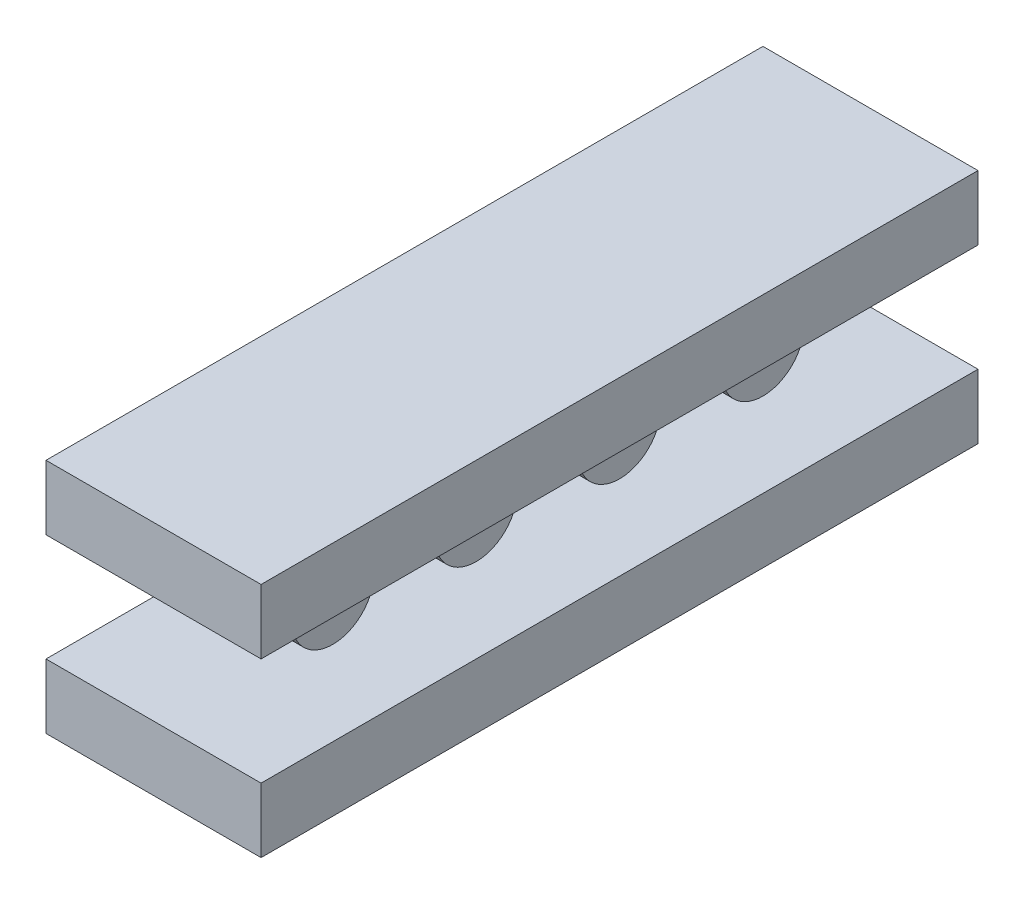
ISO-10303-21;
HEADER;
FILE_DESCRIPTION(('STEP AP214'),'2;1');
FILE_NAME('part.step','',(''),(''),'','','');
FILE_SCHEMA(('AUTOMOTIVE_DESIGN { 1 0 10303 214 1 1 1 1 }'));
ENDSEC;
DATA;
#1=APPLICATION_CONTEXT('core data for automotive mechanical design processes');
#2=APPLICATION_PROTOCOL_DEFINITION('international standard','automotive_design',2000,#1);
#3=PRODUCT_CONTEXT('',#1,'mechanical');
#4=PRODUCT('Part','Part','',(#3));
#5=PRODUCT_RELATED_PRODUCT_CATEGORY('part','',(#4));
#6=PRODUCT_DEFINITION_FORMATION('','',#4);
#7=PRODUCT_DEFINITION_CONTEXT('part definition',#1,'design');
#8=PRODUCT_DEFINITION('design','',#6,#7);
#9=PRODUCT_DEFINITION_SHAPE('','',#8);
#10=(LENGTH_UNIT() NAMED_UNIT(*) SI_UNIT(.MILLI.,.METRE.));
#11=(NAMED_UNIT(*) PLANE_ANGLE_UNIT() SI_UNIT($,.RADIAN.));
#12=(NAMED_UNIT(*) SI_UNIT($,.STERADIAN.) SOLID_ANGLE_UNIT());
#13=UNCERTAINTY_MEASURE_WITH_UNIT(LENGTH_MEASURE(1.E-05),#10,'distance_accuracy_value','');
#14=(GEOMETRIC_REPRESENTATION_CONTEXT(3) GLOBAL_UNCERTAINTY_ASSIGNED_CONTEXT((#13)) GLOBAL_UNIT_ASSIGNED_CONTEXT((#10,
#11,#12)) REPRESENTATION_CONTEXT('',''));
#15=CARTESIAN_POINT('',(0.,0.,0.));
#16=DIRECTION('',(0.,0.,1.));
#17=DIRECTION('',(1.,0.,0.));
#18=AXIS2_PLACEMENT_3D('',#15,#16,#17);
#19=CARTESIAN_POINT('',(2.,0.,3.));
#20=DIRECTION('',(-1.,0.,0.));
#21=DIRECTION('',(0.,0.,1.));
#22=AXIS2_PLACEMENT_3D('',#19,#20,#21);
#23=CYLINDRICAL_SURFACE('',#22,0.575);
#24=CARTESIAN_POINT('',(2.,0.,3.));
#25=DIRECTION('',(-1.,0.,0.));
#26=DIRECTION('',(0.,0.,1.));
#27=AXIS2_PLACEMENT_3D('',#24,#25,#26);
#28=CIRCLE('',#27,0.575);
#29=CARTESIAN_POINT('',(2.,0.,3.575));
#30=VERTEX_POINT('',#29);
#31=EDGE_CURVE('E11',#30,#30,#28,.T.);
#32=ORIENTED_EDGE('',*,*,#31,.T.);
#33=EDGE_LOOP('',(#32));
#34=FACE_BOUND('',#33,.T.);
#35=CARTESIAN_POINT('',(0.,0.,3.));
#36=DIRECTION('',(-1.,0.,0.));
#37=DIRECTION('',(0.,0.,1.));
#38=AXIS2_PLACEMENT_3D('',#35,#36,#37);
#39=CIRCLE('',#38,0.575);
#40=CARTESIAN_POINT('',(0.,0.,3.575));
#41=VERTEX_POINT('',#40);
#42=EDGE_CURVE('E45',#41,#41,#39,.T.);
#43=ORIENTED_EDGE('',*,*,#42,.F.);
#44=EDGE_LOOP('',(#43));
#45=FACE_BOUND('',#44,.T.);
#46=ADVANCED_FACE('F42',(#34,#45),#23,.T.);
#47=CARTESIAN_POINT('',(2.,0.,3.));
#48=DIRECTION('',(-1.,0.,0.));
#49=DIRECTION('',(0.,0.,1.));
#50=AXIS2_PLACEMENT_3D('',#47,#48,#49);
#51=PLANE('',#50);
#52=ORIENTED_EDGE('',*,*,#31,.F.);
#53=EDGE_LOOP('',(#52));
#54=FACE_BOUND('',#53,.T.);
#55=ADVANCED_FACE('F57',(#54),#51,.F.);
#56=CARTESIAN_POINT('',(0.,0.,3.));
#57=DIRECTION('',(-1.,0.,0.));
#58=DIRECTION('',(0.,0.,1.));
#59=AXIS2_PLACEMENT_3D('',#56,#57,#58);
#60=PLANE('',#59);
#61=ORIENTED_EDGE('',*,*,#42,.T.);
#62=EDGE_LOOP('',(#61));
#63=FACE_BOUND('',#62,.T.);
#64=ADVANCED_FACE('F54',(#63),#60,.T.);
#65=CLOSED_SHELL('',(#46,#55,#64));
#66=MANIFOLD_SOLID_BREP('B2',#65);
#67=CARTESIAN_POINT('',(2.,0.,1.));
#68=DIRECTION('',(-1.,0.,0.));
#69=DIRECTION('',(0.,0.,1.));
#70=AXIS2_PLACEMENT_3D('',#67,#68,#69);
#71=CYLINDRICAL_SURFACE('',#70,0.575);
#72=CARTESIAN_POINT('',(2.,0.,1.));
#73=DIRECTION('',(-1.,0.,0.));
#74=DIRECTION('',(0.,0.,1.));
#75=AXIS2_PLACEMENT_3D('',#72,#73,#74);
#76=CIRCLE('',#75,0.575);
#77=CARTESIAN_POINT('',(2.,0.,1.575));
#78=VERTEX_POINT('',#77);
#79=EDGE_CURVE('E41',#78,#78,#76,.T.);
#80=ORIENTED_EDGE('',*,*,#79,.T.);
#81=EDGE_LOOP('',(#80));
#82=FACE_BOUND('',#81,.T.);
#83=CARTESIAN_POINT('',(0.,0.,1.));
#84=DIRECTION('',(-1.,0.,0.));
#85=DIRECTION('',(0.,0.,1.));
#86=AXIS2_PLACEMENT_3D('',#83,#84,#85);
#87=CIRCLE('',#86,0.575);
#88=CARTESIAN_POINT('',(0.,0.,1.575));
#89=VERTEX_POINT('',#88);
#90=EDGE_CURVE('E94',#89,#89,#87,.T.);
#91=ORIENTED_EDGE('',*,*,#90,.F.);
#92=EDGE_LOOP('',(#91));
#93=FACE_BOUND('',#92,.T.);
#94=ADVANCED_FACE('F91',(#82,#93),#71,.T.);
#95=CARTESIAN_POINT('',(2.,0.,1.));
#96=DIRECTION('',(-1.,0.,0.));
#97=DIRECTION('',(0.,0.,1.));
#98=AXIS2_PLACEMENT_3D('',#95,#96,#97);
#99=PLANE('',#98);
#100=ORIENTED_EDGE('',*,*,#79,.F.);
#101=EDGE_LOOP('',(#100));
#102=FACE_BOUND('',#101,.T.);
#103=ADVANCED_FACE('F106',(#102),#99,.F.);
#104=CARTESIAN_POINT('',(0.,0.,1.));
#105=DIRECTION('',(-1.,0.,0.));
#106=DIRECTION('',(0.,0.,1.));
#107=AXIS2_PLACEMENT_3D('',#104,#105,#106);
#108=PLANE('',#107);
#109=ORIENTED_EDGE('',*,*,#90,.T.);
#110=EDGE_LOOP('',(#109));
#111=FACE_BOUND('',#110,.T.);
#112=ADVANCED_FACE('F103',(#111),#108,.T.);
#113=CLOSED_SHELL('',(#94,#103,#112));
#114=MANIFOLD_SOLID_BREP('B6',#113);
#115=CARTESIAN_POINT('',(2.,0.,-1.));
#116=DIRECTION('',(-1.,0.,0.));
#117=DIRECTION('',(0.,0.,1.));
#118=AXIS2_PLACEMENT_3D('',#115,#116,#117);
#119=CYLINDRICAL_SURFACE('',#118,0.575);
#120=CARTESIAN_POINT('',(2.,0.,-1.));
#121=DIRECTION('',(-1.,0.,0.));
#122=DIRECTION('',(0.,0.,1.));
#123=AXIS2_PLACEMENT_3D('',#120,#121,#122);
#124=CIRCLE('',#123,0.575);
#125=CARTESIAN_POINT('',(2.,0.,-0.425));
#126=VERTEX_POINT('',#125);
#127=EDGE_CURVE('E90',#126,#126,#124,.T.);
#128=ORIENTED_EDGE('',*,*,#127,.T.);
#129=EDGE_LOOP('',(#128));
#130=FACE_BOUND('',#129,.T.);
#131=CARTESIAN_POINT('',(0.,0.,-1.));
#132=DIRECTION('',(-1.,0.,0.));
#133=DIRECTION('',(0.,0.,1.));
#134=AXIS2_PLACEMENT_3D('',#131,#132,#133);
#135=CIRCLE('',#134,0.575);
#136=CARTESIAN_POINT('',(0.,0.,-0.425));
#137=VERTEX_POINT('',#136);
#138=EDGE_CURVE('E143',#137,#137,#135,.T.);
#139=ORIENTED_EDGE('',*,*,#138,.F.);
#140=EDGE_LOOP('',(#139));
#141=FACE_BOUND('',#140,.T.);
#142=ADVANCED_FACE('F140',(#130,#141),#119,.T.);
#143=CARTESIAN_POINT('',(2.,0.,-1.));
#144=DIRECTION('',(-1.,0.,0.));
#145=DIRECTION('',(0.,0.,1.));
#146=AXIS2_PLACEMENT_3D('',#143,#144,#145);
#147=PLANE('',#146);
#148=ORIENTED_EDGE('',*,*,#127,.F.);
#149=EDGE_LOOP('',(#148));
#150=FACE_BOUND('',#149,.T.);
#151=ADVANCED_FACE('F155',(#150),#147,.F.);
#152=CARTESIAN_POINT('',(0.,0.,-1.));
#153=DIRECTION('',(-1.,0.,0.));
#154=DIRECTION('',(0.,0.,1.));
#155=AXIS2_PLACEMENT_3D('',#152,#153,#154);
#156=PLANE('',#155);
#157=ORIENTED_EDGE('',*,*,#138,.T.);
#158=EDGE_LOOP('',(#157));
#159=FACE_BOUND('',#158,.T.);
#160=ADVANCED_FACE('F152',(#159),#156,.T.);
#161=CLOSED_SHELL('',(#142,#151,#160));
#162=MANIFOLD_SOLID_BREP('B36',#161);
#163=CARTESIAN_POINT('',(2.,0.,-3.));
#164=DIRECTION('',(-1.,0.,0.));
#165=DIRECTION('',(0.,0.,1.));
#166=AXIS2_PLACEMENT_3D('',#163,#164,#165);
#167=CYLINDRICAL_SURFACE('',#166,0.575);
#168=CARTESIAN_POINT('',(2.,0.,-3.));
#169=DIRECTION('',(-1.,0.,0.));
#170=DIRECTION('',(0.,0.,1.));
#171=AXIS2_PLACEMENT_3D('',#168,#169,#170);
#172=CIRCLE('',#171,0.575);
#173=CARTESIAN_POINT('',(2.,0.,-2.425));
#174=VERTEX_POINT('',#173);
#175=EDGE_CURVE('E139',#174,#174,#172,.T.);
#176=ORIENTED_EDGE('',*,*,#175,.T.);
#177=EDGE_LOOP('',(#176));
#178=FACE_BOUND('',#177,.T.);
#179=CARTESIAN_POINT('',(0.,0.,-3.));
#180=DIRECTION('',(-1.,0.,0.));
#181=DIRECTION('',(0.,0.,1.));
#182=AXIS2_PLACEMENT_3D('',#179,#180,#181);
#183=CIRCLE('',#182,0.575);
#184=CARTESIAN_POINT('',(0.,0.,-2.425));
#185=VERTEX_POINT('',#184);
#186=EDGE_CURVE('E194',#185,#185,#183,.T.);
#187=ORIENTED_EDGE('',*,*,#186,.F.);
#188=EDGE_LOOP('',(#187));
#189=FACE_BOUND('',#188,.T.);
#190=ADVANCED_FACE('F191',(#178,#189),#167,.T.);
#191=CARTESIAN_POINT('',(2.,0.,-3.));
#192=DIRECTION('',(-1.,0.,0.));
#193=DIRECTION('',(0.,0.,1.));
#194=AXIS2_PLACEMENT_3D('',#191,#192,#193);
#195=PLANE('',#194);
#196=ORIENTED_EDGE('',*,*,#175,.F.);
#197=EDGE_LOOP('',(#196));
#198=FACE_BOUND('',#197,.T.);
#199=ADVANCED_FACE('F206',(#198),#195,.F.);
#200=CARTESIAN_POINT('',(0.,0.,-3.));
#201=DIRECTION('',(-1.,0.,0.));
#202=DIRECTION('',(0.,0.,1.));
#203=AXIS2_PLACEMENT_3D('',#200,#201,#202);
#204=PLANE('',#203);
#205=ORIENTED_EDGE('',*,*,#186,.T.);
#206=EDGE_LOOP('',(#205));
#207=FACE_BOUND('',#206,.T.);
#208=ADVANCED_FACE('F203',(#207),#204,.T.);
#209=CLOSED_SHELL('',(#190,#199,#208));
#210=MANIFOLD_SOLID_BREP('B85',#209);
#211=CARTESIAN_POINT('',(3.,-1.65,5.));
#212=DIRECTION('',(0.,0.,-1.));
#213=DIRECTION('',(-1.,0.,0.));
#214=AXIS2_PLACEMENT_3D('',#211,#212,#213);
#215=PLANE('',#214);
#216=DIRECTION('',(0.,-1.,0.));
#217=VECTOR('',#216,1.);
#218=CARTESIAN_POINT('',(0.,-1.65,5.));
#219=LINE('',#218,#217);
#220=CARTESIAN_POINT('',(0.,-0.750000000000001,5.));
#221=VERTEX_POINT('',#220);
#222=CARTESIAN_POINT('',(0.,-1.65,5.));
#223=VERTEX_POINT('',#222);
#224=EDGE_CURVE('E304',#221,#223,#219,.T.);
#225=ORIENTED_EDGE('',*,*,#224,.T.);
#226=DIRECTION('',(-1.,0.,0.));
#227=VECTOR('',#226,1.);
#228=CARTESIAN_POINT('',(3.,-1.65,5.));
#229=LINE('',#228,#227);
#230=CARTESIAN_POINT('',(3.,-1.65,5.));
#231=VERTEX_POINT('',#230);
#232=EDGE_CURVE('E189',#231,#223,#229,.T.);
#233=ORIENTED_EDGE('',*,*,#232,.F.);
#234=DIRECTION('',(0.,-1.,0.));
#235=VECTOR('',#234,1.);
#236=CARTESIAN_POINT('',(3.,-1.65,5.));
#237=LINE('',#236,#235);
#238=CARTESIAN_POINT('',(3.,-0.750000000000001,5.));
#239=VERTEX_POINT('',#238);
#240=EDGE_CURVE('E292',#239,#231,#237,.T.);
#241=ORIENTED_EDGE('',*,*,#240,.F.);
#242=DIRECTION('',(-1.,0.,0.));
#243=VECTOR('',#242,1.);
#244=CARTESIAN_POINT('',(3.,-0.750000000000001,5.));
#245=LINE('',#244,#243);
#246=EDGE_CURVE('E300',#239,#221,#245,.T.);
#247=ORIENTED_EDGE('',*,*,#246,.T.);
#248=EDGE_LOOP('',(#225,#233,#241,#247));
#249=FACE_BOUND('',#248,.T.);
#250=ADVANCED_FACE('F241',(#249),#215,.F.);
#251=CARTESIAN_POINT('',(3.,-1.65,-5.));
#252=DIRECTION('',(0.,1.,0.));
#253=DIRECTION('',(0.,0.,1.));
#254=AXIS2_PLACEMENT_3D('',#251,#252,#253);
#255=PLANE('',#254);
#256=DIRECTION('',(0.,0.,-1.));
#257=VECTOR('',#256,1.);
#258=CARTESIAN_POINT('',(0.,-1.65,-5.));
#259=LINE('',#258,#257);
#260=CARTESIAN_POINT('',(0.,-1.65,-5.));
#261=VERTEX_POINT('',#260);
#262=EDGE_CURVE('E296',#223,#261,#259,.T.);
#263=ORIENTED_EDGE('',*,*,#262,.T.);
#264=DIRECTION('',(-1.,0.,0.));
#265=VECTOR('',#264,1.);
#266=CARTESIAN_POINT('',(3.,-1.65,-5.));
#267=LINE('',#266,#265);
#268=CARTESIAN_POINT('',(3.,-1.65,-5.));
#269=VERTEX_POINT('',#268);
#270=EDGE_CURVE('E249',#269,#261,#267,.T.);
#271=ORIENTED_EDGE('',*,*,#270,.F.);
#272=DIRECTION('',(0.,0.,-1.));
#273=VECTOR('',#272,1.);
#274=CARTESIAN_POINT('',(3.,-1.65,-5.));
#275=LINE('',#274,#273);
#276=EDGE_CURVE('E287',#231,#269,#275,.T.);
#277=ORIENTED_EDGE('',*,*,#276,.F.);
#278=ORIENTED_EDGE('',*,*,#232,.T.);
#279=EDGE_LOOP('',(#263,#271,#277,#278));
#280=FACE_BOUND('',#279,.T.);
#281=ADVANCED_FACE('F295',(#280),#255,.F.);
#282=CARTESIAN_POINT('',(3.,-1.65,-5.));
#283=DIRECTION('',(0.,0.,1.));
#284=DIRECTION('',(1.,0.,0.));
#285=AXIS2_PLACEMENT_3D('',#282,#283,#284);
#286=PLANE('',#285);
#287=DIRECTION('',(0.,1.,0.));
#288=VECTOR('',#287,1.);
#289=CARTESIAN_POINT('',(0.,-1.65,-5.));
#290=LINE('',#289,#288);
#291=CARTESIAN_POINT('',(0.,-0.75,-5.));
#292=VERTEX_POINT('',#291);
#293=EDGE_CURVE('E274',#261,#292,#290,.T.);
#294=ORIENTED_EDGE('',*,*,#293,.T.);
#295=DIRECTION('',(-1.,0.,0.));
#296=VECTOR('',#295,1.);
#297=CARTESIAN_POINT('',(3.,-0.75,-5.));
#298=LINE('',#297,#296);
#299=CARTESIAN_POINT('',(3.,-0.75,-5.));
#300=VERTEX_POINT('',#299);
#301=EDGE_CURVE('E297',#300,#292,#298,.T.);
#302=ORIENTED_EDGE('',*,*,#301,.F.);
#303=DIRECTION('',(0.,1.,0.));
#304=VECTOR('',#303,1.);
#305=CARTESIAN_POINT('',(3.,-1.65,-5.));
#306=LINE('',#305,#304);
#307=EDGE_CURVE('E290',#269,#300,#306,.T.);
#308=ORIENTED_EDGE('',*,*,#307,.F.);
#309=ORIENTED_EDGE('',*,*,#270,.T.);
#310=EDGE_LOOP('',(#294,#302,#308,#309));
#311=FACE_BOUND('',#310,.T.);
#312=ADVANCED_FACE('F298',(#311),#286,.F.);
#313=CARTESIAN_POINT('',(3.,-0.75,-5.));
#314=DIRECTION('',(0.,-1.,0.));
#315=DIRECTION('',(0.,0.,-1.));
#316=AXIS2_PLACEMENT_3D('',#313,#314,#315);
#317=PLANE('',#316);
#318=DIRECTION('',(0.,0.,1.));
#319=VECTOR('',#318,1.);
#320=CARTESIAN_POINT('',(0.,-0.75,-5.));
#321=LINE('',#320,#319);
#322=EDGE_CURVE('E280',#292,#221,#321,.T.);
#323=ORIENTED_EDGE('',*,*,#322,.T.);
#324=ORIENTED_EDGE('',*,*,#246,.F.);
#325=DIRECTION('',(0.,0.,1.));
#326=VECTOR('',#325,1.);
#327=CARTESIAN_POINT('',(3.,-0.75,-5.));
#328=LINE('',#327,#326);
#329=EDGE_CURVE('E257',#300,#239,#328,.T.);
#330=ORIENTED_EDGE('',*,*,#329,.F.);
#331=ORIENTED_EDGE('',*,*,#301,.T.);
#332=EDGE_LOOP('',(#323,#324,#330,#331));
#333=FACE_BOUND('',#332,.T.);
#334=ADVANCED_FACE('F311',(#333),#317,.F.);
#335=CARTESIAN_POINT('',(3.,0.,0.));
#336=DIRECTION('',(1.,0.,0.));
#337=DIRECTION('',(0.,0.,-1.));
#338=AXIS2_PLACEMENT_3D('',#335,#336,#337);
#339=PLANE('',#338);
#340=ORIENTED_EDGE('',*,*,#240,.T.);
#341=ORIENTED_EDGE('',*,*,#276,.T.);
#342=ORIENTED_EDGE('',*,*,#307,.T.);
#343=ORIENTED_EDGE('',*,*,#329,.T.);
#344=EDGE_LOOP('',(#340,#341,#342,#343));
#345=FACE_BOUND('',#344,.T.);
#346=ADVANCED_FACE('F288',(#345),#339,.T.);
#347=CARTESIAN_POINT('',(0.,0.,0.));
#348=DIRECTION('',(1.,0.,0.));
#349=DIRECTION('',(0.,0.,-1.));
#350=AXIS2_PLACEMENT_3D('',#347,#348,#349);
#351=PLANE('',#350);
#352=ORIENTED_EDGE('',*,*,#224,.F.);
#353=ORIENTED_EDGE('',*,*,#322,.F.);
#354=ORIENTED_EDGE('',*,*,#293,.F.);
#355=ORIENTED_EDGE('',*,*,#262,.F.);
#356=EDGE_LOOP('',(#352,#353,#354,#355));
#357=FACE_BOUND('',#356,.T.);
#358=ADVANCED_FACE('F314',(#357),#351,.F.);
#359=CLOSED_SHELL('',(#250,#281,#312,#334,#346,#358));
#360=MANIFOLD_SOLID_BREP('B134',#359);
#361=CARTESIAN_POINT('',(3.,0.749999999999998,5.));
#362=DIRECTION('',(0.,0.,-1.));
#363=DIRECTION('',(0.,1.,0.));
#364=AXIS2_PLACEMENT_3D('',#361,#362,#363);
#365=PLANE('',#364);
#366=DIRECTION('',(0.,-1.,0.));
#367=VECTOR('',#366,1.);
#368=CARTESIAN_POINT('',(0.,0.749999999999998,5.));
#369=LINE('',#368,#367);
#370=CARTESIAN_POINT('',(0.,1.65,5.));
#371=VERTEX_POINT('',#370);
#372=CARTESIAN_POINT('',(0.,0.749999999999998,5.));
#373=VERTEX_POINT('',#372);
#374=EDGE_CURVE('E428',#371,#373,#369,.T.);
#375=ORIENTED_EDGE('',*,*,#374,.T.);
#376=DIRECTION('',(-1.,0.,0.));
#377=VECTOR('',#376,1.);
#378=CARTESIAN_POINT('',(3.,0.749999999999998,5.));
#379=LINE('',#378,#377);
#380=CARTESIAN_POINT('',(3.,0.749999999999998,5.));
#381=VERTEX_POINT('',#380);
#382=EDGE_CURVE('E239',#381,#373,#379,.T.);
#383=ORIENTED_EDGE('',*,*,#382,.F.);
#384=DIRECTION('',(0.,-1.,0.));
#385=VECTOR('',#384,1.);
#386=CARTESIAN_POINT('',(3.,0.749999999999998,5.));
#387=LINE('',#386,#385);
#388=CARTESIAN_POINT('',(3.,1.65,5.));
#389=VERTEX_POINT('',#388);
#390=EDGE_CURVE('E416',#389,#381,#387,.T.);
#391=ORIENTED_EDGE('',*,*,#390,.F.);
#392=DIRECTION('',(-1.,0.,0.));
#393=VECTOR('',#392,1.);
#394=CARTESIAN_POINT('',(3.,1.65,5.));
#395=LINE('',#394,#393);
#396=EDGE_CURVE('E424',#389,#371,#395,.T.);
#397=ORIENTED_EDGE('',*,*,#396,.T.);
#398=EDGE_LOOP('',(#375,#383,#391,#397));
#399=FACE_BOUND('',#398,.T.);
#400=ADVANCED_FACE('F365',(#399),#365,.F.);
#401=CARTESIAN_POINT('',(3.,0.749999999999999,-5.));
#402=DIRECTION('',(0.,1.,0.));
#403=DIRECTION('',(0.,0.,1.));
#404=AXIS2_PLACEMENT_3D('',#401,#402,#403);
#405=PLANE('',#404);
#406=DIRECTION('',(0.,0.,-1.));
#407=VECTOR('',#406,1.);
#408=CARTESIAN_POINT('',(0.,0.749999999999999,-5.));
#409=LINE('',#408,#407);
#410=CARTESIAN_POINT('',(0.,0.749999999999999,-5.));
#411=VERTEX_POINT('',#410);
#412=EDGE_CURVE('E420',#373,#411,#409,.T.);
#413=ORIENTED_EDGE('',*,*,#412,.T.);
#414=DIRECTION('',(-1.,0.,0.));
#415=VECTOR('',#414,1.);
#416=CARTESIAN_POINT('',(3.,0.749999999999999,-5.));
#417=LINE('',#416,#415);
#418=CARTESIAN_POINT('',(3.,0.749999999999999,-5.));
#419=VERTEX_POINT('',#418);
#420=EDGE_CURVE('E373',#419,#411,#417,.T.);
#421=ORIENTED_EDGE('',*,*,#420,.F.);
#422=DIRECTION('',(0.,0.,-1.));
#423=VECTOR('',#422,1.);
#424=CARTESIAN_POINT('',(3.,0.749999999999999,-5.));
#425=LINE('',#424,#423);
#426=EDGE_CURVE('E411',#381,#419,#425,.T.);
#427=ORIENTED_EDGE('',*,*,#426,.F.);
#428=ORIENTED_EDGE('',*,*,#382,.T.);
#429=EDGE_LOOP('',(#413,#421,#427,#428));
#430=FACE_BOUND('',#429,.T.);
#431=ADVANCED_FACE('F419',(#430),#405,.F.);
#432=CARTESIAN_POINT('',(3.,0.749999999999999,-5.));
#433=DIRECTION('',(0.,0.,1.));
#434=DIRECTION('',(1.,0.,0.));
#435=AXIS2_PLACEMENT_3D('',#432,#433,#434);
#436=PLANE('',#435);
#437=DIRECTION('',(0.,1.,0.));
#438=VECTOR('',#437,1.);
#439=CARTESIAN_POINT('',(0.,0.749999999999999,-5.));
#440=LINE('',#439,#438);
#441=CARTESIAN_POINT('',(0.,1.65,-5.));
#442=VERTEX_POINT('',#441);
#443=EDGE_CURVE('E398',#411,#442,#440,.T.);
#444=ORIENTED_EDGE('',*,*,#443,.T.);
#445=DIRECTION('',(-1.,0.,0.));
#446=VECTOR('',#445,1.);
#447=CARTESIAN_POINT('',(3.,1.65,-5.));
#448=LINE('',#447,#446);
#449=CARTESIAN_POINT('',(3.,1.65,-5.));
#450=VERTEX_POINT('',#449);
#451=EDGE_CURVE('E421',#450,#442,#448,.T.);
#452=ORIENTED_EDGE('',*,*,#451,.F.);
#453=DIRECTION('',(0.,1.,0.));
#454=VECTOR('',#453,1.);
#455=CARTESIAN_POINT('',(3.,0.749999999999999,-5.));
#456=LINE('',#455,#454);
#457=EDGE_CURVE('E414',#419,#450,#456,.T.);
#458=ORIENTED_EDGE('',*,*,#457,.F.);
#459=ORIENTED_EDGE('',*,*,#420,.T.);
#460=EDGE_LOOP('',(#444,#452,#458,#459));
#461=FACE_BOUND('',#460,.T.);
#462=ADVANCED_FACE('F422',(#461),#436,.F.);
#463=CARTESIAN_POINT('',(3.,1.65,-5.));
#464=DIRECTION('',(0.,-1.,0.));
#465=DIRECTION('',(0.,0.,-1.));
#466=AXIS2_PLACEMENT_3D('',#463,#464,#465);
#467=PLANE('',#466);
#468=DIRECTION('',(0.,0.,1.));
#469=VECTOR('',#468,1.);
#470=CARTESIAN_POINT('',(0.,1.65,-5.));
#471=LINE('',#470,#469);
#472=EDGE_CURVE('E404',#442,#371,#471,.T.);
#473=ORIENTED_EDGE('',*,*,#472,.T.);
#474=ORIENTED_EDGE('',*,*,#396,.F.);
#475=DIRECTION('',(0.,0.,1.));
#476=VECTOR('',#475,1.);
#477=CARTESIAN_POINT('',(3.,1.65,-5.));
#478=LINE('',#477,#476);
#479=EDGE_CURVE('E381',#450,#389,#478,.T.);
#480=ORIENTED_EDGE('',*,*,#479,.F.);
#481=ORIENTED_EDGE('',*,*,#451,.T.);
#482=EDGE_LOOP('',(#473,#474,#480,#481));
#483=FACE_BOUND('',#482,.T.);
#484=ADVANCED_FACE('F435',(#483),#467,.F.);
#485=CARTESIAN_POINT('',(3.,0.,0.));
#486=DIRECTION('',(1.,0.,0.));
#487=DIRECTION('',(0.,0.,-1.));
#488=AXIS2_PLACEMENT_3D('',#485,#486,#487);
#489=PLANE('',#488);
#490=ORIENTED_EDGE('',*,*,#390,.T.);
#491=ORIENTED_EDGE('',*,*,#426,.T.);
#492=ORIENTED_EDGE('',*,*,#457,.T.);
#493=ORIENTED_EDGE('',*,*,#479,.T.);
#494=EDGE_LOOP('',(#490,#491,#492,#493));
#495=FACE_BOUND('',#494,.T.);
#496=ADVANCED_FACE('F412',(#495),#489,.T.);
#497=CARTESIAN_POINT('',(0.,0.,0.));
#498=DIRECTION('',(1.,0.,0.));
#499=DIRECTION('',(0.,0.,-1.));
#500=AXIS2_PLACEMENT_3D('',#497,#498,#499);
#501=PLANE('',#500);
#502=ORIENTED_EDGE('',*,*,#374,.F.);
#503=ORIENTED_EDGE('',*,*,#472,.F.);
#504=ORIENTED_EDGE('',*,*,#443,.F.);
#505=ORIENTED_EDGE('',*,*,#412,.F.);
#506=EDGE_LOOP('',(#502,#503,#504,#505));
#507=FACE_BOUND('',#506,.T.);
#508=ADVANCED_FACE('F438',(#507),#501,.F.);
#509=CLOSED_SHELL('',(#400,#431,#462,#484,#496,#508));
#510=MANIFOLD_SOLID_BREP('B183',#509);
#511=ADVANCED_BREP_SHAPE_REPRESENTATION('',(#18,#66,#114,#162,#210,#360,#510),#14);
#512=SHAPE_DEFINITION_REPRESENTATION(#9,#511);
ENDSEC;
END-ISO-10303-21;
